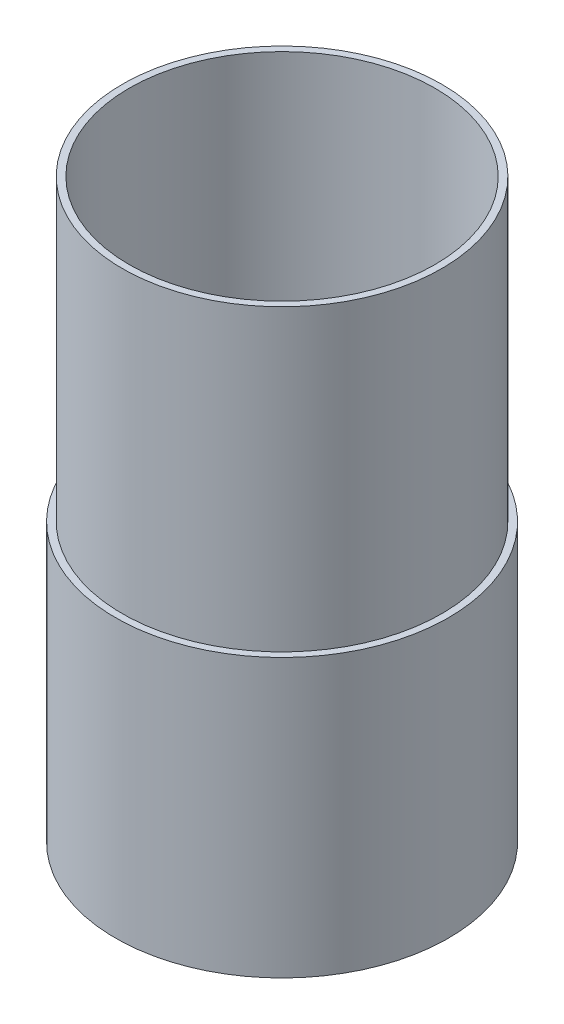
ISO-10303-21;
HEADER;
FILE_DESCRIPTION(('STEP AP214'),'2;1');
FILE_NAME('part.step','',(''),(''),'','','');
FILE_SCHEMA(('AUTOMOTIVE_DESIGN { 1 0 10303 214 1 1 1 1 }'));
ENDSEC;
DATA;
#1=APPLICATION_CONTEXT('core data for automotive mechanical design processes');
#2=APPLICATION_PROTOCOL_DEFINITION('international standard','automotive_design',2000,#1);
#3=PRODUCT_CONTEXT('',#1,'mechanical');
#4=PRODUCT('Part','Part','',(#3));
#5=PRODUCT_RELATED_PRODUCT_CATEGORY('part','',(#4));
#6=PRODUCT_DEFINITION_FORMATION('','',#4);
#7=PRODUCT_DEFINITION_CONTEXT('part definition',#1,'design');
#8=PRODUCT_DEFINITION('design','',#6,#7);
#9=PRODUCT_DEFINITION_SHAPE('','',#8);
#10=(LENGTH_UNIT() NAMED_UNIT(*) SI_UNIT(.MILLI.,.METRE.));
#11=(NAMED_UNIT(*) PLANE_ANGLE_UNIT() SI_UNIT($,.RADIAN.));
#12=(NAMED_UNIT(*) SI_UNIT($,.STERADIAN.) SOLID_ANGLE_UNIT());
#13=UNCERTAINTY_MEASURE_WITH_UNIT(LENGTH_MEASURE(1.E-05),#10,'distance_accuracy_value','');
#14=(GEOMETRIC_REPRESENTATION_CONTEXT(3) GLOBAL_UNCERTAINTY_ASSIGNED_CONTEXT((#13)) GLOBAL_UNIT_ASSIGNED_CONTEXT((#10,
#11,#12)) REPRESENTATION_CONTEXT('',''));
#15=CARTESIAN_POINT('',(0.,0.,0.));
#16=DIRECTION('',(0.,0.,1.));
#17=DIRECTION('',(1.,0.,0.));
#18=AXIS2_PLACEMENT_3D('',#15,#16,#17);
#19=CARTESIAN_POINT('',(0.,0.,0.));
#20=DIRECTION('',(0.,1.,0.));
#21=DIRECTION('',(0.,0.,1.));
#22=AXIS2_PLACEMENT_3D('',#19,#20,#21);
#23=PLANE('',#22);
#24=CARTESIAN_POINT('',(45.466,0.,0.));
#25=DIRECTION('',(0.,-1.,0.));
#26=DIRECTION('',(0.,0.,-1.));
#27=AXIS2_PLACEMENT_3D('',#24,#25,#26);
#28=CIRCLE('',#27,45.466);
#29=CARTESIAN_POINT('',(45.466,0.,-45.466));
#30=VERTEX_POINT('',#29);
#31=EDGE_CURVE('E63',#30,#30,#28,.T.);
#32=ORIENTED_EDGE('',*,*,#31,.F.);
#33=EDGE_LOOP('',(#32));
#34=FACE_BOUND('',#33,.T.);
#35=CARTESIAN_POINT('',(45.466,0.,0.));
#36=DIRECTION('',(0.,-1.,0.));
#37=DIRECTION('',(0.,0.,-1.));
#38=AXIS2_PLACEMENT_3D('',#35,#36,#37);
#39=CIRCLE('',#38,49.53);
#40=CARTESIAN_POINT('',(45.466,0.,-49.53));
#41=VERTEX_POINT('',#40);
#42=EDGE_CURVE('E10',#41,#41,#39,.T.);
#43=ORIENTED_EDGE('',*,*,#42,.T.);
#44=EDGE_LOOP('',(#43));
#45=FACE_BOUND('',#44,.T.);
#46=ADVANCED_FACE('F41',(#34,#45),#23,.F.);
#47=CARTESIAN_POINT('',(45.466,0.,0.));
#48=DIRECTION('',(0.,-1.,0.));
#49=DIRECTION('',(0.,0.,-1.));
#50=AXIS2_PLACEMENT_3D('',#47,#48,#49);
#51=CYLINDRICAL_SURFACE('',#50,49.53);
#52=ORIENTED_EDGE('',*,*,#42,.F.);
#53=EDGE_LOOP('',(#52));
#54=FACE_BOUND('',#53,.T.);
#55=CARTESIAN_POINT('',(45.466,82.55,0.));
#56=DIRECTION('',(0.,-1.,0.));
#57=DIRECTION('',(0.,0.,-1.));
#58=AXIS2_PLACEMENT_3D('',#55,#56,#57);
#59=CIRCLE('',#58,49.53);
#60=CARTESIAN_POINT('',(45.466,82.55,-49.53));
#61=VERTEX_POINT('',#60);
#62=EDGE_CURVE('E47',#61,#61,#59,.T.);
#63=ORIENTED_EDGE('',*,*,#62,.T.);
#64=EDGE_LOOP('',(#63));
#65=FACE_BOUND('',#64,.T.);
#66=ADVANCED_FACE('F70',(#54,#65),#51,.T.);
#67=CARTESIAN_POINT('',(-4.064,82.55,0.));
#68=DIRECTION('',(0.,-1.,0.));
#69=DIRECTION('',(0.,0.,-1.));
#70=AXIS2_PLACEMENT_3D('',#67,#68,#69);
#71=PLANE('',#70);
#72=ORIENTED_EDGE('',*,*,#62,.F.);
#73=EDGE_LOOP('',(#72));
#74=FACE_BOUND('',#73,.T.);
#75=CARTESIAN_POINT('',(45.466,82.55,0.));
#76=DIRECTION('',(0.,-1.,0.));
#77=DIRECTION('',(0.,0.,-1.));
#78=AXIS2_PLACEMENT_3D('',#75,#76,#77);
#79=CIRCLE('',#78,47.498);
#80=CARTESIAN_POINT('',(45.466,82.55,-47.498));
#81=VERTEX_POINT('',#80);
#82=EDGE_CURVE('E51',#81,#81,#79,.T.);
#83=ORIENTED_EDGE('',*,*,#82,.T.);
#84=EDGE_LOOP('',(#83));
#85=FACE_BOUND('',#84,.T.);
#86=ADVANCED_FACE('F74',(#74,#85),#71,.F.);
#87=CARTESIAN_POINT('',(45.466,0.,0.));
#88=DIRECTION('',(0.,-1.,0.));
#89=DIRECTION('',(0.,0.,-1.));
#90=AXIS2_PLACEMENT_3D('',#87,#88,#89);
#91=CYLINDRICAL_SURFACE('',#90,47.498);
#92=ORIENTED_EDGE('',*,*,#82,.F.);
#93=EDGE_LOOP('',(#92));
#94=FACE_BOUND('',#93,.T.);
#95=CARTESIAN_POINT('',(45.466,171.45,0.));
#96=DIRECTION('',(0.,-1.,0.));
#97=DIRECTION('',(0.,0.,-1.));
#98=AXIS2_PLACEMENT_3D('',#95,#96,#97);
#99=CIRCLE('',#98,47.498);
#100=CARTESIAN_POINT('',(45.466,171.45,-47.498));
#101=VERTEX_POINT('',#100);
#102=EDGE_CURVE('E55',#101,#101,#99,.T.);
#103=ORIENTED_EDGE('',*,*,#102,.T.);
#104=EDGE_LOOP('',(#103));
#105=FACE_BOUND('',#104,.T.);
#106=ADVANCED_FACE('F79',(#94,#105),#91,.T.);
#107=CARTESIAN_POINT('',(-2.032,171.45,0.));
#108=DIRECTION('',(0.,-1.,0.));
#109=DIRECTION('',(0.,0.,-1.));
#110=AXIS2_PLACEMENT_3D('',#107,#108,#109);
#111=PLANE('',#110);
#112=ORIENTED_EDGE('',*,*,#102,.F.);
#113=EDGE_LOOP('',(#112));
#114=FACE_BOUND('',#113,.T.);
#115=CARTESIAN_POINT('',(45.466,171.45,0.));
#116=DIRECTION('',(0.,-1.,0.));
#117=DIRECTION('',(0.,0.,-1.));
#118=AXIS2_PLACEMENT_3D('',#115,#116,#117);
#119=CIRCLE('',#118,45.466);
#120=CARTESIAN_POINT('',(45.466,171.45,-45.466));
#121=VERTEX_POINT('',#120);
#122=EDGE_CURVE('E60',#121,#121,#119,.T.);
#123=ORIENTED_EDGE('',*,*,#122,.T.);
#124=EDGE_LOOP('',(#123));
#125=FACE_BOUND('',#124,.T.);
#126=ADVANCED_FACE('F85',(#114,#125),#111,.F.);
#127=CARTESIAN_POINT('',(45.466,0.,0.));
#128=DIRECTION('',(0.,-1.,0.));
#129=DIRECTION('',(0.,0.,-1.));
#130=AXIS2_PLACEMENT_3D('',#127,#128,#129);
#131=CYLINDRICAL_SURFACE('',#130,45.466);
#132=ORIENTED_EDGE('',*,*,#122,.F.);
#133=EDGE_LOOP('',(#132));
#134=FACE_BOUND('',#133,.T.);
#135=ORIENTED_EDGE('',*,*,#31,.T.);
#136=EDGE_LOOP('',(#135));
#137=FACE_BOUND('',#136,.T.);
#138=ADVANCED_FACE('F67',(#134,#137),#131,.F.);
#139=CLOSED_SHELL('',(#46,#66,#86,#106,#126,#138));
#140=MANIFOLD_SOLID_BREP('B2',#139);
#141=ADVANCED_BREP_SHAPE_REPRESENTATION('',(#18,#140),#14);
#142=SHAPE_DEFINITION_REPRESENTATION(#9,#141);
ENDSEC;
END-ISO-10303-21;
